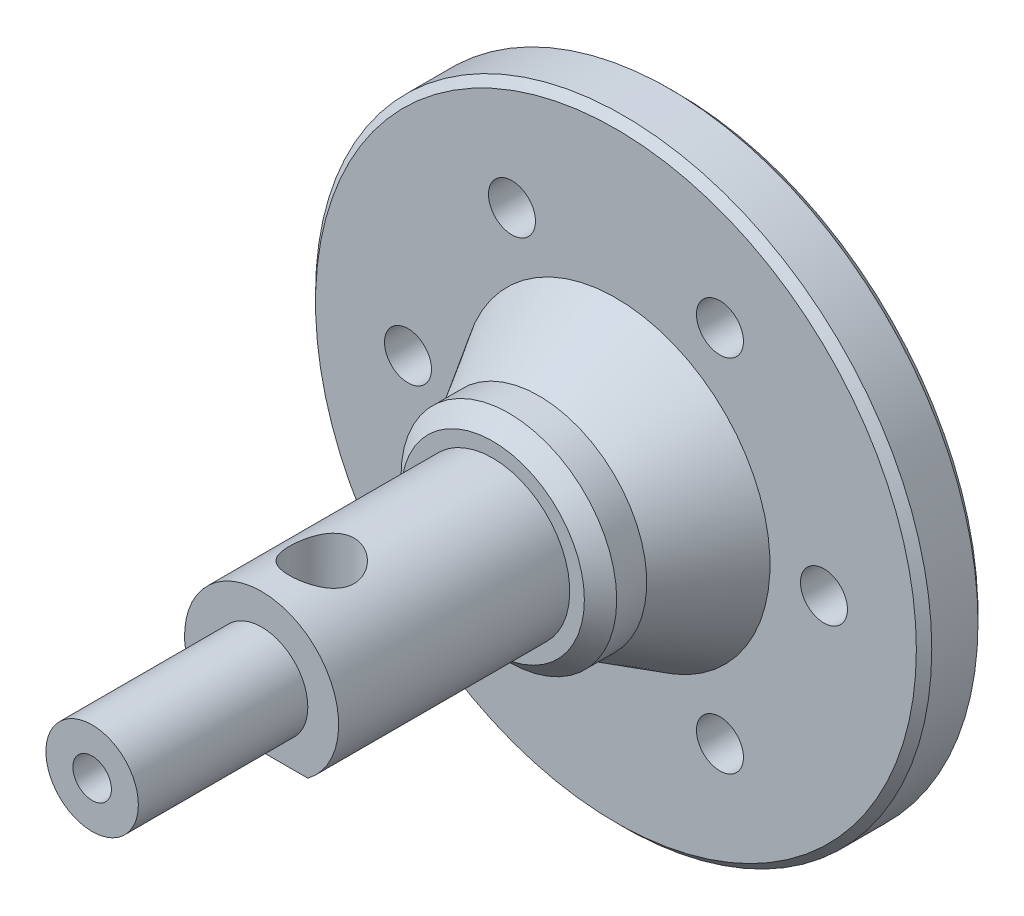
ISO-10303-21;
HEADER;
FILE_DESCRIPTION(('STEP AP214'),'2;1');
FILE_NAME('part.step','',(''),(''),'','','');
FILE_SCHEMA(('AUTOMOTIVE_DESIGN { 1 0 10303 214 1 1 1 1 }'));
ENDSEC;
DATA;
#1=APPLICATION_CONTEXT('core data for automotive mechanical design processes');
#2=APPLICATION_PROTOCOL_DEFINITION('international standard','automotive_design',2000,#1);
#3=PRODUCT_CONTEXT('',#1,'mechanical');
#4=PRODUCT('Part','Part','',(#3));
#5=PRODUCT_RELATED_PRODUCT_CATEGORY('part','',(#4));
#6=PRODUCT_DEFINITION_FORMATION('','',#4);
#7=PRODUCT_DEFINITION_CONTEXT('part definition',#1,'design');
#8=PRODUCT_DEFINITION('design','',#6,#7);
#9=PRODUCT_DEFINITION_SHAPE('','',#8);
#10=(LENGTH_UNIT() NAMED_UNIT(*) SI_UNIT(.MILLI.,.METRE.));
#11=(NAMED_UNIT(*) PLANE_ANGLE_UNIT() SI_UNIT($,.RADIAN.));
#12=(NAMED_UNIT(*) SI_UNIT($,.STERADIAN.) SOLID_ANGLE_UNIT());
#13=UNCERTAINTY_MEASURE_WITH_UNIT(LENGTH_MEASURE(1.E-05),#10,'distance_accuracy_value','');
#14=(GEOMETRIC_REPRESENTATION_CONTEXT(3) GLOBAL_UNCERTAINTY_ASSIGNED_CONTEXT((#13)) GLOBAL_UNIT_ASSIGNED_CONTEXT((#10,
#11,#12)) REPRESENTATION_CONTEXT('',''));
#15=CARTESIAN_POINT('',(0.,0.,0.));
#16=DIRECTION('',(0.,0.,1.));
#17=DIRECTION('',(1.,0.,0.));
#18=AXIS2_PLACEMENT_3D('',#15,#16,#17);
#19=CARTESIAN_POINT('',(0.,0.,9.));
#20=DIRECTION('',(0.,0.,-1.));
#21=DIRECTION('',(-1.,0.,0.));
#22=AXIS2_PLACEMENT_3D('',#19,#20,#21);
#23=CYLINDRICAL_SURFACE('',#22,7.);
#24=CARTESIAN_POINT('',(0.,0.,7.95));
#25=DIRECTION('',(0.,0.,1.));
#26=DIRECTION('',(1.,0.,0.));
#27=AXIS2_PLACEMENT_3D('',#24,#25,#26);
#28=CIRCLE('',#27,7.);
#29=CARTESIAN_POINT('',(7.,0.,7.95));
#30=VERTEX_POINT('',#29);
#31=EDGE_CURVE('E161',#30,#30,#28,.F.);
#32=ORIENTED_EDGE('',*,*,#31,.T.);
#33=EDGE_LOOP('',(#32));
#34=FACE_BOUND('',#33,.T.);
#35=CARTESIAN_POINT('',(0.,0.,6.00000000000002));
#36=DIRECTION('',(0.,0.,-1.));
#37=DIRECTION('',(-1.,0.,0.));
#38=AXIS2_PLACEMENT_3D('',#35,#36,#37);
#39=CIRCLE('',#38,7.);
#40=CARTESIAN_POINT('',(-7.,0.,6.00000000000002));
#41=VERTEX_POINT('',#40);
#42=EDGE_CURVE('E12',#41,#41,#39,.T.);
#43=ORIENTED_EDGE('',*,*,#42,.F.);
#44=EDGE_LOOP('',(#43));
#45=FACE_BOUND('',#44,.T.);
#46=ADVANCED_FACE('F49',(#34,#45),#23,.T.);
#47=CARTESIAN_POINT('',(0.,0.,9.));
#48=DIRECTION('',(0.,0.,1.));
#49=DIRECTION('',(1.,0.,0.));
#50=AXIS2_PLACEMENT_3D('',#47,#48,#49);
#51=PLANE('',#50);
#52=CARTESIAN_POINT('',(0.,0.,9.));
#53=DIRECTION('',(0.,0.,1.));
#54=DIRECTION('',(1.,0.,0.));
#55=AXIS2_PLACEMENT_3D('',#52,#53,#54);
#56=CIRCLE('',#55,5.95);
#57=CARTESIAN_POINT('',(5.95,0.,9.));
#58=VERTEX_POINT('',#57);
#59=EDGE_CURVE('E178',#58,#58,#56,.T.);
#60=ORIENTED_EDGE('',*,*,#59,.T.);
#61=EDGE_LOOP('',(#60));
#62=FACE_BOUND('',#61,.T.);
#63=CARTESIAN_POINT('',(0.,0.,9.));
#64=DIRECTION('',(0.,0.,1.));
#65=DIRECTION('',(1.,0.,0.));
#66=AXIS2_PLACEMENT_3D('',#63,#64,#65);
#67=CIRCLE('',#66,5.);
#68=CARTESIAN_POINT('',(3.,-4.,9.));
#69=VERTEX_POINT('',#68);
#70=CARTESIAN_POINT('',(-3.,-4.,9.));
#71=VERTEX_POINT('',#70);
#72=EDGE_CURVE('E174',#69,#71,#67,.T.);
#73=ORIENTED_EDGE('',*,*,#72,.F.);
#74=DIRECTION('',(-1.,0.,0.));
#75=VECTOR('',#74,1.);
#76=CARTESIAN_POINT('',(-3.,-4.,9.));
#77=LINE('',#76,#75);
#78=EDGE_CURVE('E162',#69,#71,#77,.T.);
#79=ORIENTED_EDGE('',*,*,#78,.T.);
#80=EDGE_LOOP('',(#73,#79));
#81=FACE_BOUND('',#80,.T.);
#82=ADVANCED_FACE('F220',(#62,#81),#51,.T.);
#83=CARTESIAN_POINT('',(0.,0.,24.));
#84=DIRECTION('',(0.,0.,-1.));
#85=DIRECTION('',(-1.,0.,0.));
#86=AXIS2_PLACEMENT_3D('',#83,#84,#85);
#87=CYLINDRICAL_SURFACE('',#86,5.);
#88=CARTESIAN_POINT('',(0.,5.,18.));
#89=CARTESIAN_POINT('',(0.112421260581153,4.99999333081063,18.0000087486642));
#90=CARTESIAN_POINT('',(0.22500040718686,4.99616592841195,18.0090785835812));
#91=CARTESIAN_POINT('',(0.446972248377442,4.98123118003201,18.0450254946232));
#92=CARTESIAN_POINT('',(0.556355935732328,4.97010500635269,18.0719486265488));
#93=CARTESIAN_POINT('',(0.768350398152637,4.94176430599483,18.1424330646887));
#94=CARTESIAN_POINT('',(0.870982883258437,4.92457055376415,18.1859376388004));
#95=CARTESIAN_POINT('',(1.06739278830025,4.8857658190477,18.2881128513417));
#96=CARTESIAN_POINT('',(1.16117280038008,4.8641561355186,18.3467790312891));
#97=CARTESIAN_POINT('',(1.34213382613879,4.81744880427699,18.4807616252732));
#98=CARTESIAN_POINT('',(1.42880573971968,4.79223574286274,18.5567250374545));
#99=CARTESIAN_POINT('',(1.58861874618106,4.74165902719199,18.7217771478338));
#100=CARTESIAN_POINT('',(1.66175260846298,4.71629529988631,18.8108728145304));
#101=CARTESIAN_POINT('',(1.79604183081053,4.66686358992508,19.0050780482677));
#102=CARTESIAN_POINT('',(1.8564119623006,4.64292449321022,19.110766844819));
#103=CARTESIAN_POINT('',(1.9582903452905,4.60088674913594,19.3319493636433));
#104=CARTESIAN_POINT('',(1.99980846754017,4.58278504680929,19.4474379171635));
#105=CARTESIAN_POINT('',(2.06069339629842,4.55572282316872,19.6790813748024));
#106=CARTESIAN_POINT('',(2.08104088310874,4.54635990340002,19.7949296749258));
#107=CARTESIAN_POINT('',(2.1020655645863,4.53668036024209,20.0287453768029));
#108=CARTESIAN_POINT('',(2.10275385885088,4.53635863218973,20.1467115451554));
#109=CARTESIAN_POINT('',(2.08517838863868,4.54445782632958,20.3715727342699));
#110=CARTESIAN_POINT('',(2.0683911211407,4.55219766109082,20.4786126533639));
#111=CARTESIAN_POINT('',(2.01882069425823,4.57439532890143,20.6881859698907));
#112=CARTESIAN_POINT('',(1.98603441325926,4.58885447294869,20.7907184836127));
#113=CARTESIAN_POINT('',(1.9047552653891,4.62318960000861,20.9909771898547));
#114=CARTESIAN_POINT('',(1.85594072765769,4.64317507109548,21.0885532080903));
#115=CARTESIAN_POINT('',(1.74421855126708,4.6862864975772,21.2745124807557));
#116=CARTESIAN_POINT('',(1.68130530506478,4.70941370110216,21.3628920569053));
#117=CARTESIAN_POINT('',(1.53682141436928,4.75862189879711,21.5359495731647));
#118=CARTESIAN_POINT('',(1.4541115363858,4.78478586969401,21.619655508531));
#119=CARTESIAN_POINT('',(1.27557303481868,4.83544396849842,21.7723379348816));
#120=CARTESIAN_POINT('',(1.17974124865652,4.85993769171256,21.8413108646979));
#121=CARTESIAN_POINT('',(0.974684985251579,4.90522758617355,21.9640261549959));
#122=CARTESIAN_POINT('',(0.865196096354339,4.92592190978332,22.0173670667239));
#123=CARTESIAN_POINT('',(0.637707645332215,4.96049707707325,22.1045304798802));
#124=CARTESIAN_POINT('',(0.519712906376766,4.97438174778904,22.1383639464055));
#125=CARTESIAN_POINT('',(0.286679920590251,4.99305470954801,22.1835035656391));
#126=CARTESIAN_POINT('',(0.171936368129354,4.9983686606607,22.1961137879832));
#127=CARTESIAN_POINT('',(-0.0581412446748196,5.00098385227943,22.2023443427462));
#128=CARTESIAN_POINT('',(-0.173475122118157,4.99828744042502,22.1959702390007));
#129=CARTESIAN_POINT('',(-0.395312373831661,4.98552504990215,22.1653412569326));
#130=CARTESIAN_POINT('',(-0.501967273863913,4.9758388790051,22.1420074752713));
#131=CARTESIAN_POINT('',(-0.709728637835148,4.95047932164883,22.0794093172166));
#132=CARTESIAN_POINT('',(-0.810834401783569,4.93480518181903,22.0401429362399));
#133=CARTESIAN_POINT('',(-1.00818189714743,4.8983626516293,21.9455130438461));
#134=CARTESIAN_POINT('',(-1.10417428723488,4.87745088709505,21.8896865485196));
#135=CARTESIAN_POINT('',(-1.28577300174089,4.83275775989048,21.7640291266551));
#136=CARTESIAN_POINT('',(-1.37137493586436,4.80897519262205,21.6941923131493));
#137=CARTESIAN_POINT('',(-1.53629380491231,4.75896603015302,21.5365709384711));
#138=CARTESIAN_POINT('',(-1.61470399849414,4.73268731102285,21.4478517714703));
#139=CARTESIAN_POINT('',(-1.75578239792247,4.68218504424203,21.2581054214289));
#140=CARTESIAN_POINT('',(-1.81844681280031,4.65796199244367,21.1570752830647));
#141=CARTESIAN_POINT('',(-1.92699302654218,4.61412955516253,20.9433676622428));
#142=CARTESIAN_POINT('',(-1.97260446871616,4.59459611805935,20.8305361230827));
#143=CARTESIAN_POINT('',(-2.04378702108545,4.56338397318404,20.5977144401677));
#144=CARTESIAN_POINT('',(-2.06937501482837,4.55169864915186,20.4777304193847));
#145=CARTESIAN_POINT('',(-2.09809375316399,4.53852721320538,20.2440877222975));
#146=CARTESIAN_POINT('',(-2.10281966121277,4.53631703032197,20.1306650987772));
#147=CARTESIAN_POINT('',(-2.09395263112574,4.54041709192146,19.9047070537751));
#148=CARTESIAN_POINT('',(-2.08036261579429,4.54672597695538,19.7921714936204));
#149=CARTESIAN_POINT('',(-2.03659654382613,4.56648699353874,19.5767598151772));
#150=CARTESIAN_POINT('',(-2.00724892567787,4.57958128170967,19.473679389714));
#151=CARTESIAN_POINT('',(-1.93361811208318,4.61115138706684,19.273885759783));
#152=CARTESIAN_POINT('',(-1.8893307059875,4.62962872121731,19.1771743595644));
#153=CARTESIAN_POINT('',(-1.78398506506627,4.67127236761429,18.9864581481377));
#154=CARTESIAN_POINT('',(-1.72207244546471,4.69465512938922,18.8929734165771));
#155=CARTESIAN_POINT('',(-1.58442236783439,4.74288120419634,18.7172211743398));
#156=CARTESIAN_POINT('',(-1.50867999331673,4.76772503450352,18.6349576710467));
#157=CARTESIAN_POINT('',(-1.33881414331682,4.81829681676583,18.4776737751763));
#158=CARTESIAN_POINT('',(-1.24374163979691,4.84395273633481,18.4036496464243));
#159=CARTESIAN_POINT('',(-1.04160910493705,4.89140406157461,18.2725495671045));
#160=CARTESIAN_POINT('',(-0.934543653723432,4.91319771021995,18.2154813221667));
#161=CARTESIAN_POINT('',(-0.712909694659769,4.95016391652071,18.1211131144848));
#162=CARTESIAN_POINT('',(-0.598488891919434,4.96543696653597,18.0835110625867));
#163=CARTESIAN_POINT('',(-0.423046442527793,4.98242021609108,18.0421727421728));
#164=CARTESIAN_POINT('',(-0.363983932156318,4.98709206933622,18.0309073949576));
#165=CARTESIAN_POINT('',(-0.244993842675941,4.99434801176813,18.013476395024));
#166=CARTESIAN_POINT('',(-0.185066849625885,4.99693345339788,18.0073074386877));
#167=CARTESIAN_POINT('',(-0.083378891468915,4.99947925927613,18.0012402094917));
#168=CARTESIAN_POINT('',(-0.0417003073719691,5.00000247379584,17.9999967548666));
#169=CARTESIAN_POINT('',(0.,5.,18.));
#170=B_SPLINE_CURVE_WITH_KNOTS('',3,(#88,#89,#90,#91,#92,#93,#94,#95,#96,#97,#98,#99,#100,#101,
#102,#103,#104,#105,#106,#107,#108,#109,#110,#111,#112,#113,#114,#115,#116,#117,#118,#119,#120,
#121,#122,#123,#124,#125,#126,#127,#128,#129,#130,#131,#132,#133,#134,#135,#136,#137,#138,#139,
#140,#141,#142,#143,#144,#145,#146,#147,#148,#149,#150,#151,#152,#153,#154,#155,#156,#157,#158,
#159,#160,#161,#162,#163,#164,#165,#166,#167,#168,#169),.UNSPECIFIED.,.T.,.F.,(4,2,2,2,2,2,2,2,
2,2,2,2,2,2,2,2,2,2,2,2,2,2,2,2,2,2,2,2,2,2,2,2,2,2,2,2,2,2,2,2,4),(0.,0.337117852409665,
0.675108761991061,1.01195349481189,1.34869928621511,1.70109212353727,2.05367263229608,
2.42394551964457,2.79402431110357,3.14607251211165,3.4979219424653,3.82228185888043,
4.14670508743035,4.47808378319004,4.80959451436098,5.16961532097,5.52972305127827,
5.89839924827029,6.26686801055249,6.61173647653919,6.95650388006769,7.28382587678933,
7.61118906878407,7.94874145558539,8.28643597605329,8.64863382013127,9.01091878393071,
9.37872565541541,9.74622206108762,10.0850701575655,10.4238641880037,10.7463772236012,
11.0689812327412,11.4111551885347,11.7534510251224,12.121249113885,12.4892140943469,
12.851283305836,13.0320009112092,13.2126012784391,13.337648071131),.UNSPECIFIED.);
#171=CARTESIAN_POINT('',(0.,5.,18.));
#172=VERTEX_POINT('',#171);
#173=EDGE_CURVE('E54',#172,#172,#170,.T.);
#174=ORIENTED_EDGE('',*,*,#173,.T.);
#175=EDGE_LOOP('',(#174));
#176=FACE_BOUND('',#175,.T.);
#177=CARTESIAN_POINT('',(0.,0.,24.));
#178=DIRECTION('',(0.,0.,1.));
#179=DIRECTION('',(1.,0.,0.));
#180=AXIS2_PLACEMENT_3D('',#177,#178,#179);
#181=CIRCLE('',#180,5.);
#182=CARTESIAN_POINT('',(3.,-4.,24.));
#183=VERTEX_POINT('',#182);
#184=CARTESIAN_POINT('',(-3.,-4.,24.));
#185=VERTEX_POINT('',#184);
#186=EDGE_CURVE('E169',#183,#185,#181,.T.);
#187=ORIENTED_EDGE('',*,*,#186,.F.);
#188=DIRECTION('',(0.,0.,1.));
#189=VECTOR('',#188,1.);
#190=CARTESIAN_POINT('',(3.,-4.,9.));
#191=LINE('',#190,#189);
#192=EDGE_CURVE('E73',#69,#183,#191,.T.);
#193=ORIENTED_EDGE('',*,*,#192,.F.);
#194=ORIENTED_EDGE('',*,*,#72,.T.);
#195=DIRECTION('',(0.,0.,1.));
#196=VECTOR('',#195,1.);
#197=CARTESIAN_POINT('',(-3.,-4.,9.));
#198=LINE('',#197,#196);
#199=EDGE_CURVE('E79',#71,#185,#198,.T.);
#200=ORIENTED_EDGE('',*,*,#199,.T.);
#201=EDGE_LOOP('',(#187,#193,#194,#200));
#202=FACE_BOUND('',#201,.T.);
#203=ADVANCED_FACE('F226',(#176,#202),#87,.T.);
#204=CARTESIAN_POINT('',(0.,0.,24.));
#205=DIRECTION('',(0.,0.,1.));
#206=DIRECTION('',(1.,0.,0.));
#207=AXIS2_PLACEMENT_3D('',#204,#205,#206);
#208=PLANE('',#207);
#209=CARTESIAN_POINT('',(0.,0.,24.));
#210=DIRECTION('',(0.,0.,1.));
#211=DIRECTION('',(1.,0.,0.));
#212=AXIS2_PLACEMENT_3D('',#209,#210,#211);
#213=CIRCLE('',#212,3.);
#214=CARTESIAN_POINT('',(3.,0.,24.));
#215=VERTEX_POINT('',#214);
#216=EDGE_CURVE('E156',#215,#215,#213,.T.);
#217=ORIENTED_EDGE('',*,*,#216,.F.);
#218=EDGE_LOOP('',(#217));
#219=FACE_BOUND('',#218,.T.);
#220=DIRECTION('',(-1.,0.,0.));
#221=VECTOR('',#220,1.);
#222=CARTESIAN_POINT('',(-3.,-4.,24.));
#223=LINE('',#222,#221);
#224=EDGE_CURVE('E85',#183,#185,#223,.T.);
#225=ORIENTED_EDGE('',*,*,#224,.F.);
#226=ORIENTED_EDGE('',*,*,#186,.T.);
#227=EDGE_LOOP('',(#225,#226));
#228=FACE_BOUND('',#227,.T.);
#229=ADVANCED_FACE('F262',(#219,#228),#208,.T.);
#230=CARTESIAN_POINT('',(0.,0.,9.));
#231=DIRECTION('',(0.,0.,-1.));
#232=DIRECTION('',(-1.,0.,0.));
#233=AXIS2_PLACEMENT_3D('',#230,#231,#232);
#234=CONICAL_SURFACE('',#233,5.95,0.785398163397448);
#235=ORIENTED_EDGE('',*,*,#31,.F.);
#236=EDGE_LOOP('',(#235));
#237=FACE_BOUND('',#236,.T.);
#238=ORIENTED_EDGE('',*,*,#59,.F.);
#239=EDGE_LOOP('',(#238));
#240=FACE_BOUND('',#239,.T.);
#241=ADVANCED_FACE('F256',(#237,#240),#234,.T.);
#242=CARTESIAN_POINT('',(-3.,-4.,9.));
#243=DIRECTION('',(0.,1.,0.));
#244=DIRECTION('',(0.,0.,1.));
#245=AXIS2_PLACEMENT_3D('',#242,#243,#244);
#246=PLANE('',#245);
#247=CARTESIAN_POINT('',(0.,-4.,20.1));
#248=DIRECTION('',(0.,-1.,0.));
#249=DIRECTION('',(0.,0.,-1.));
#250=AXIS2_PLACEMENT_3D('',#247,#248,#249);
#251=CIRCLE('',#250,2.09999999999999);
#252=CARTESIAN_POINT('',(0.,-4.,18.));
#253=VERTEX_POINT('',#252);
#254=EDGE_CURVE('E348',#253,#253,#251,.T.);
#255=ORIENTED_EDGE('',*,*,#254,.F.);
#256=EDGE_LOOP('',(#255));
#257=FACE_BOUND('',#256,.T.);
#258=ORIENTED_EDGE('',*,*,#224,.T.);
#259=ORIENTED_EDGE('',*,*,#199,.F.);
#260=ORIENTED_EDGE('',*,*,#78,.F.);
#261=ORIENTED_EDGE('',*,*,#192,.T.);
#262=EDGE_LOOP('',(#258,#259,#260,#261));
#263=FACE_BOUND('',#262,.T.);
#264=ADVANCED_FACE('F261',(#257,#263),#246,.F.);
#265=CARTESIAN_POINT('',(0.,0.,34.));
#266=DIRECTION('',(0.,0.,-1.));
#267=DIRECTION('',(-1.,0.,0.));
#268=AXIS2_PLACEMENT_3D('',#265,#266,#267);
#269=CYLINDRICAL_SURFACE('',#268,3.);
#270=ORIENTED_EDGE('',*,*,#216,.T.);
#271=EDGE_LOOP('',(#270));
#272=FACE_BOUND('',#271,.T.);
#273=CARTESIAN_POINT('',(0.,0.,35.));
#274=DIRECTION('',(0.,0.,1.));
#275=DIRECTION('',(1.,0.,0.));
#276=AXIS2_PLACEMENT_3D('',#273,#274,#275);
#277=CIRCLE('',#276,3.);
#278=CARTESIAN_POINT('',(3.,0.,35.));
#279=VERTEX_POINT('',#278);
#280=EDGE_CURVE('E99',#279,#279,#277,.T.);
#281=ORIENTED_EDGE('',*,*,#280,.F.);
#282=EDGE_LOOP('',(#281));
#283=FACE_BOUND('',#282,.T.);
#284=ADVANCED_FACE('F323',(#272,#283),#269,.T.);
#285=CARTESIAN_POINT('',(0.,0.,35.));
#286=DIRECTION('',(0.,0.,1.));
#287=DIRECTION('',(1.,0.,0.));
#288=AXIS2_PLACEMENT_3D('',#285,#286,#287);
#289=PLANE('',#288);
#290=CARTESIAN_POINT('',(0.,0.,35.));
#291=DIRECTION('',(0.,0.,1.));
#292=DIRECTION('',(1.,0.,0.));
#293=AXIS2_PLACEMENT_3D('',#290,#291,#292);
#294=CIRCLE('',#293,1.24999999999999);
#295=CARTESIAN_POINT('',(1.24999999999999,0.,35.));
#296=VERTEX_POINT('',#295);
#297=EDGE_CURVE('E100',#296,#296,#294,.T.);
#298=ORIENTED_EDGE('',*,*,#297,.F.);
#299=EDGE_LOOP('',(#298));
#300=FACE_BOUND('',#299,.T.);
#301=ORIENTED_EDGE('',*,*,#280,.T.);
#302=EDGE_LOOP('',(#301));
#303=FACE_BOUND('',#302,.T.);
#304=ADVANCED_FACE('F92',(#300,#303),#289,.T.);
#305=CARTESIAN_POINT('',(0.,0.,30.));
#306=DIRECTION('',(0.,0.,1.));
#307=DIRECTION('',(1.,0.,0.));
#308=AXIS2_PLACEMENT_3D('',#305,#306,#307);
#309=CONICAL_SURFACE('',#308,1.24999999999999,1.02974425867665);
#310=CARTESIAN_POINT('',(0.,0.,29.2489242262156));
#311=VERTEX_POINT('',#310);
#312=VERTEX_LOOP('',#311);
#313=FACE_BOUND('',#312,.T.);
#314=CARTESIAN_POINT('',(0.,0.,30.));
#315=DIRECTION('',(0.,0.,1.));
#316=DIRECTION('',(1.,0.,0.));
#317=AXIS2_PLACEMENT_3D('',#314,#315,#316);
#318=CIRCLE('',#317,1.24999999999999);
#319=CARTESIAN_POINT('',(1.24999999999999,0.,30.));
#320=VERTEX_POINT('',#319);
#321=EDGE_CURVE('E96',#320,#320,#318,.T.);
#322=ORIENTED_EDGE('',*,*,#321,.T.);
#323=EDGE_LOOP('',(#322));
#324=FACE_BOUND('',#323,.T.);
#325=ADVANCED_FACE('F88',(#313,#324),#309,.F.);
#326=CARTESIAN_POINT('',(0.,0.,35.));
#327=DIRECTION('',(0.,0.,1.));
#328=DIRECTION('',(1.,0.,0.));
#329=AXIS2_PLACEMENT_3D('',#326,#327,#328);
#330=CYLINDRICAL_SURFACE('',#329,1.24999999999999);
#331=ORIENTED_EDGE('',*,*,#321,.F.);
#332=EDGE_LOOP('',(#331));
#333=FACE_BOUND('',#332,.T.);
#334=ORIENTED_EDGE('',*,*,#297,.T.);
#335=EDGE_LOOP('',(#334));
#336=FACE_BOUND('',#335,.T.);
#337=ADVANCED_FACE('F91',(#333,#336),#330,.F.);
#338=CARTESIAN_POINT('',(0.,-4.,20.1));
#339=DIRECTION('',(0.,-1.,0.));
#340=DIRECTION('',(0.,0.,-1.));
#341=AXIS2_PLACEMENT_3D('',#338,#339,#340);
#342=CYLINDRICAL_SURFACE('',#341,2.09999999999999);
#343=ORIENTED_EDGE('',*,*,#254,.T.);
#344=EDGE_LOOP('',(#343));
#345=FACE_BOUND('',#344,.T.);
#346=ORIENTED_EDGE('',*,*,#173,.F.);
#347=EDGE_LOOP('',(#346));
#348=FACE_BOUND('',#347,.T.);
#349=ADVANCED_FACE('F276',(#345,#348),#342,.F.);
#350=CARTESIAN_POINT('',(0.,0.,6.83333333333333));
#351=DIRECTION('',(0.,0.,-1.));
#352=DIRECTION('',(-1.,0.,0.));
#353=AXIS2_PLACEMENT_3D('',#350,#351,#352);
#354=CONICAL_SURFACE('',#353,6.50000000000001,0.540419500270584);
#355=CARTESIAN_POINT('',(0.,0.,1.));
#356=DIRECTION('',(0.,0.,-1.));
#357=DIRECTION('',(-1.,0.,0.));
#358=AXIS2_PLACEMENT_3D('',#355,#356,#357);
#359=CIRCLE('',#358,10.);
#360=CARTESIAN_POINT('',(-10.,0.,1.));
#361=VERTEX_POINT('',#360);
#362=EDGE_CURVE('E350',#361,#361,#359,.T.);
#363=ORIENTED_EDGE('',*,*,#362,.F.);
#364=EDGE_LOOP('',(#363));
#365=FACE_BOUND('',#364,.T.);
#366=ORIENTED_EDGE('',*,*,#42,.T.);
#367=EDGE_LOOP('',(#366));
#368=FACE_BOUND('',#367,.T.);
#369=ADVANCED_FACE('F268',(#365,#368),#354,.T.);
#370=CARTESIAN_POINT('',(0.,0.,-3.));
#371=DIRECTION('',(0.,0.,1.));
#372=DIRECTION('',(1.,0.,0.));
#373=AXIS2_PLACEMENT_3D('',#370,#371,#372);
#374=CONICAL_SURFACE('',#373,19.5,0.785398163397441);
#375=CARTESIAN_POINT('',(0.,0.,-2.5));
#376=DIRECTION('',(0.,0.,-1.));
#377=DIRECTION('',(-1.,0.,0.));
#378=AXIS2_PLACEMENT_3D('',#375,#376,#377);
#379=CIRCLE('',#378,20.);
#380=CARTESIAN_POINT('',(-20.,0.,-2.5));
#381=VERTEX_POINT('',#380);
#382=EDGE_CURVE('E195',#381,#381,#379,.F.);
#383=ORIENTED_EDGE('',*,*,#382,.F.);
#384=EDGE_LOOP('',(#383));
#385=FACE_BOUND('',#384,.T.);
#386=CARTESIAN_POINT('',(0.,0.,-3.));
#387=DIRECTION('',(0.,0.,-1.));
#388=DIRECTION('',(-1.,0.,0.));
#389=AXIS2_PLACEMENT_3D('',#386,#387,#388);
#390=CIRCLE('',#389,19.5);
#391=CARTESIAN_POINT('',(-19.5,0.,-3.));
#392=VERTEX_POINT('',#391);
#393=EDGE_CURVE('E160',#392,#392,#390,.T.);
#394=ORIENTED_EDGE('',*,*,#393,.F.);
#395=EDGE_LOOP('',(#394));
#396=FACE_BOUND('',#395,.T.);
#397=ADVANCED_FACE('F264',(#385,#396),#374,.T.);
#398=CARTESIAN_POINT('',(0.,0.,-3.));
#399=DIRECTION('',(0.,0.,-1.));
#400=DIRECTION('',(-1.,0.,0.));
#401=AXIS2_PLACEMENT_3D('',#398,#399,#400);
#402=PLANE('',#401);
#403=ORIENTED_EDGE('',*,*,#393,.T.);
#404=EDGE_LOOP('',(#403));
#405=FACE_BOUND('',#404,.T.);
#406=CARTESIAN_POINT('',(13.5,0.,-3.));
#407=DIRECTION('',(0.,0.,-1.));
#408=DIRECTION('',(-1.,0.,0.));
#409=AXIS2_PLACEMENT_3D('',#406,#407,#408);
#410=CIRCLE('',#409,1.525);
#411=CARTESIAN_POINT('',(11.975,0.,-3.));
#412=VERTEX_POINT('',#411);
#413=EDGE_CURVE('E137',#412,#412,#410,.T.);
#414=ORIENTED_EDGE('',*,*,#413,.F.);
#415=EDGE_LOOP('',(#414));
#416=FACE_BOUND('',#415,.T.);
#417=CARTESIAN_POINT('',(-6.75000000000005,-11.6913429510899,-3.));
#418=DIRECTION('',(0.,0.,-1.));
#419=DIRECTION('',(-1.,0.,0.));
#420=AXIS2_PLACEMENT_3D('',#417,#418,#419);
#421=CIRCLE('',#420,1.525);
#422=CARTESIAN_POINT('',(-8.27500000000006,-11.6913429510899,-3.));
#423=VERTEX_POINT('',#422);
#424=EDGE_CURVE('E145',#423,#423,#421,.T.);
#425=ORIENTED_EDGE('',*,*,#424,.F.);
#426=EDGE_LOOP('',(#425));
#427=FACE_BOUND('',#426,.T.);
#428=CARTESIAN_POINT('',(-6.74999999999989,11.69134295109,-3.));
#429=DIRECTION('',(0.,0.,-1.));
#430=DIRECTION('',(-1.,0.,0.));
#431=AXIS2_PLACEMENT_3D('',#428,#429,#430);
#432=CIRCLE('',#431,1.525);
#433=CARTESIAN_POINT('',(-8.27499999999989,11.69134295109,-3.));
#434=VERTEX_POINT('',#433);
#435=EDGE_CURVE('E152',#434,#434,#432,.T.);
#436=ORIENTED_EDGE('',*,*,#435,.F.);
#437=EDGE_LOOP('',(#436));
#438=FACE_BOUND('',#437,.T.);
#439=CARTESIAN_POINT('',(-13.5,0.,-3.));
#440=DIRECTION('',(0.,0.,-1.));
#441=DIRECTION('',(-1.,0.,0.));
#442=AXIS2_PLACEMENT_3D('',#439,#440,#441);
#443=CIRCLE('',#442,1.525);
#444=CARTESIAN_POINT('',(-15.025,0.,-3.));
#445=VERTEX_POINT('',#444);
#446=EDGE_CURVE('E148',#445,#445,#443,.T.);
#447=ORIENTED_EDGE('',*,*,#446,.F.);
#448=EDGE_LOOP('',(#447));
#449=FACE_BOUND('',#448,.T.);
#450=CARTESIAN_POINT('',(6.74999999999997,-11.6913429510899,-3.));
#451=DIRECTION('',(0.,0.,-1.));
#452=DIRECTION('',(-1.,0.,0.));
#453=AXIS2_PLACEMENT_3D('',#450,#451,#452);
#454=CIRCLE('',#453,1.525);
#455=CARTESIAN_POINT('',(5.22499999999997,-11.6913429510899,-3.));
#456=VERTEX_POINT('',#455);
#457=EDGE_CURVE('E141',#456,#456,#454,.T.);
#458=ORIENTED_EDGE('',*,*,#457,.F.);
#459=EDGE_LOOP('',(#458));
#460=FACE_BOUND('',#459,.T.);
#461=CARTESIAN_POINT('',(6.75000000000014,11.6913429510898,-3.));
#462=DIRECTION('',(0.,0.,-1.));
#463=DIRECTION('',(-1.,0.,0.));
#464=AXIS2_PLACEMENT_3D('',#461,#462,#463);
#465=CIRCLE('',#464,1.525);
#466=CARTESIAN_POINT('',(5.22500000000014,11.6913429510898,-3.));
#467=VERTEX_POINT('',#466);
#468=EDGE_CURVE('E133',#467,#467,#465,.T.);
#469=ORIENTED_EDGE('',*,*,#468,.F.);
#470=EDGE_LOOP('',(#469));
#471=FACE_BOUND('',#470,.T.);
#472=ADVANCED_FACE('F253',(#405,#416,#427,#438,#449,#460,#471),#402,.T.);
#473=CARTESIAN_POINT('',(0.,0.,5.));
#474=DIRECTION('',(0.,0.,-1.));
#475=DIRECTION('',(-1.,0.,0.));
#476=AXIS2_PLACEMENT_3D('',#473,#474,#475);
#477=CYLINDRICAL_SURFACE('',#476,20.);
#478=ORIENTED_EDGE('',*,*,#382,.T.);
#479=EDGE_LOOP('',(#478));
#480=FACE_BOUND('',#479,.T.);
#481=CARTESIAN_POINT('',(0.,0.,0.499999999999986));
#482=DIRECTION('',(0.,0.,1.));
#483=DIRECTION('',(1.,0.,0.));
#484=AXIS2_PLACEMENT_3D('',#481,#482,#483);
#485=CIRCLE('',#484,20.);
#486=CARTESIAN_POINT('',(20.,0.,0.499999999999986));
#487=VERTEX_POINT('',#486);
#488=EDGE_CURVE('E191',#487,#487,#485,.F.);
#489=ORIENTED_EDGE('',*,*,#488,.T.);
#490=EDGE_LOOP('',(#489));
#491=FACE_BOUND('',#490,.T.);
#492=ADVANCED_FACE('F239',(#480,#491),#477,.T.);
#493=CARTESIAN_POINT('',(6.74999999999997,-11.6913429510899,0.));
#494=DIRECTION('',(0.,0.,1.));
#495=DIRECTION('',(1.,0.,0.));
#496=AXIS2_PLACEMENT_3D('',#493,#494,#495);
#497=CYLINDRICAL_SURFACE('',#496,1.525);
#498=ORIENTED_EDGE('',*,*,#457,.T.);
#499=EDGE_LOOP('',(#498));
#500=FACE_BOUND('',#499,.T.);
#501=CARTESIAN_POINT('',(6.74999999999997,-11.6913429510899,1.));
#502=DIRECTION('',(0.,0.,1.));
#503=DIRECTION('',(1.,0.,0.));
#504=AXIS2_PLACEMENT_3D('',#501,#502,#503);
#505=CIRCLE('',#504,1.525);
#506=CARTESIAN_POINT('',(8.27499999999997,-11.6913429510899,1.));
#507=VERTEX_POINT('',#506);
#508=EDGE_CURVE('E129',#507,#507,#505,.F.);
#509=ORIENTED_EDGE('',*,*,#508,.F.);
#510=EDGE_LOOP('',(#509));
#511=FACE_BOUND('',#510,.T.);
#512=ADVANCED_FACE('F235',(#500,#511),#497,.F.);
#513=CARTESIAN_POINT('',(-6.75000000000005,-11.6913429510899,0.));
#514=DIRECTION('',(0.,0.,1.));
#515=DIRECTION('',(1.,0.,0.));
#516=AXIS2_PLACEMENT_3D('',#513,#514,#515);
#517=CYLINDRICAL_SURFACE('',#516,1.525);
#518=ORIENTED_EDGE('',*,*,#424,.T.);
#519=EDGE_LOOP('',(#518));
#520=FACE_BOUND('',#519,.T.);
#521=CARTESIAN_POINT('',(-6.75000000000005,-11.6913429510899,1.));
#522=DIRECTION('',(0.,0.,1.));
#523=DIRECTION('',(1.,0.,0.));
#524=AXIS2_PLACEMENT_3D('',#521,#522,#523);
#525=CIRCLE('',#524,1.525);
#526=CARTESIAN_POINT('',(-5.22500000000005,-11.6913429510899,1.));
#527=VERTEX_POINT('',#526);
#528=EDGE_CURVE('E125',#527,#527,#525,.F.);
#529=ORIENTED_EDGE('',*,*,#528,.F.);
#530=EDGE_LOOP('',(#529));
#531=FACE_BOUND('',#530,.T.);
#532=ADVANCED_FACE('F238',(#520,#531),#517,.F.);
#533=CARTESIAN_POINT('',(-13.5,0.,0.));
#534=DIRECTION('',(0.,0.,1.));
#535=DIRECTION('',(1.,0.,0.));
#536=AXIS2_PLACEMENT_3D('',#533,#534,#535);
#537=CYLINDRICAL_SURFACE('',#536,1.525);
#538=ORIENTED_EDGE('',*,*,#446,.T.);
#539=EDGE_LOOP('',(#538));
#540=FACE_BOUND('',#539,.T.);
#541=CARTESIAN_POINT('',(-13.5,0.,1.));
#542=DIRECTION('',(0.,0.,1.));
#543=DIRECTION('',(1.,0.,0.));
#544=AXIS2_PLACEMENT_3D('',#541,#542,#543);
#545=CIRCLE('',#544,1.525);
#546=CARTESIAN_POINT('',(-11.975,0.,1.));
#547=VERTEX_POINT('',#546);
#548=EDGE_CURVE('E121',#547,#547,#545,.F.);
#549=ORIENTED_EDGE('',*,*,#548,.F.);
#550=EDGE_LOOP('',(#549));
#551=FACE_BOUND('',#550,.T.);
#552=ADVANCED_FACE('F243',(#540,#551),#537,.F.);
#553=CARTESIAN_POINT('',(-6.74999999999989,11.69134295109,0.));
#554=DIRECTION('',(0.,0.,1.));
#555=DIRECTION('',(1.,0.,0.));
#556=AXIS2_PLACEMENT_3D('',#553,#554,#555);
#557=CYLINDRICAL_SURFACE('',#556,1.525);
#558=ORIENTED_EDGE('',*,*,#435,.T.);
#559=EDGE_LOOP('',(#558));
#560=FACE_BOUND('',#559,.T.);
#561=CARTESIAN_POINT('',(-6.74999999999989,11.69134295109,1.));
#562=DIRECTION('',(0.,0.,1.));
#563=DIRECTION('',(1.,0.,0.));
#564=AXIS2_PLACEMENT_3D('',#561,#562,#563);
#565=CIRCLE('',#564,1.525);
#566=CARTESIAN_POINT('',(-5.22499999999989,11.69134295109,1.));
#567=VERTEX_POINT('',#566);
#568=EDGE_CURVE('E117',#567,#567,#565,.F.);
#569=ORIENTED_EDGE('',*,*,#568,.F.);
#570=EDGE_LOOP('',(#569));
#571=FACE_BOUND('',#570,.T.);
#572=ADVANCED_FACE('F233',(#560,#571),#557,.F.);
#573=CARTESIAN_POINT('',(6.75000000000014,11.6913429510898,0.));
#574=DIRECTION('',(0.,0.,1.));
#575=DIRECTION('',(1.,0.,0.));
#576=AXIS2_PLACEMENT_3D('',#573,#574,#575);
#577=CYLINDRICAL_SURFACE('',#576,1.525);
#578=ORIENTED_EDGE('',*,*,#468,.T.);
#579=EDGE_LOOP('',(#578));
#580=FACE_BOUND('',#579,.T.);
#581=CARTESIAN_POINT('',(6.75000000000014,11.6913429510898,1.));
#582=DIRECTION('',(0.,0.,1.));
#583=DIRECTION('',(1.,0.,0.));
#584=AXIS2_PLACEMENT_3D('',#581,#582,#583);
#585=CIRCLE('',#584,1.525);
#586=CARTESIAN_POINT('',(8.27500000000014,11.6913429510898,1.));
#587=VERTEX_POINT('',#586);
#588=EDGE_CURVE('E113',#587,#587,#585,.F.);
#589=ORIENTED_EDGE('',*,*,#588,.F.);
#590=EDGE_LOOP('',(#589));
#591=FACE_BOUND('',#590,.T.);
#592=ADVANCED_FACE('F215',(#580,#591),#577,.F.);
#593=CARTESIAN_POINT('',(13.5,0.,0.));
#594=DIRECTION('',(0.,0.,1.));
#595=DIRECTION('',(1.,0.,0.));
#596=AXIS2_PLACEMENT_3D('',#593,#594,#595);
#597=CYLINDRICAL_SURFACE('',#596,1.525);
#598=ORIENTED_EDGE('',*,*,#413,.T.);
#599=EDGE_LOOP('',(#598));
#600=FACE_BOUND('',#599,.T.);
#601=CARTESIAN_POINT('',(13.5,0.,1.));
#602=DIRECTION('',(0.,0.,1.));
#603=DIRECTION('',(1.,0.,0.));
#604=AXIS2_PLACEMENT_3D('',#601,#602,#603);
#605=CIRCLE('',#604,1.525);
#606=CARTESIAN_POINT('',(15.025,0.,1.));
#607=VERTEX_POINT('',#606);
#608=EDGE_CURVE('E106',#607,#607,#605,.F.);
#609=ORIENTED_EDGE('',*,*,#608,.F.);
#610=EDGE_LOOP('',(#609));
#611=FACE_BOUND('',#610,.T.);
#612=ADVANCED_FACE('F207',(#600,#611),#597,.F.);
#613=CARTESIAN_POINT('',(0.,0.,1.));
#614=DIRECTION('',(0.,0.,-1.));
#615=DIRECTION('',(-1.,0.,0.));
#616=AXIS2_PLACEMENT_3D('',#613,#614,#615);
#617=CONICAL_SURFACE('',#616,19.5,0.785398163397441);
#618=ORIENTED_EDGE('',*,*,#488,.F.);
#619=EDGE_LOOP('',(#618));
#620=FACE_BOUND('',#619,.T.);
#621=CARTESIAN_POINT('',(0.,0.,1.));
#622=DIRECTION('',(0.,0.,1.));
#623=DIRECTION('',(1.,0.,0.));
#624=AXIS2_PLACEMENT_3D('',#621,#622,#623);
#625=CIRCLE('',#624,19.5);
#626=CARTESIAN_POINT('',(19.5,0.,1.));
#627=VERTEX_POINT('',#626);
#628=EDGE_CURVE('E65',#627,#627,#625,.T.);
#629=ORIENTED_EDGE('',*,*,#628,.F.);
#630=EDGE_LOOP('',(#629));
#631=FACE_BOUND('',#630,.T.);
#632=ADVANCED_FACE('F52',(#620,#631),#617,.T.);
#633=CARTESIAN_POINT('',(0.,0.,1.));
#634=DIRECTION('',(0.,0.,1.));
#635=DIRECTION('',(1.,0.,0.));
#636=AXIS2_PLACEMENT_3D('',#633,#634,#635);
#637=PLANE('',#636);
#638=ORIENTED_EDGE('',*,*,#362,.T.);
#639=EDGE_LOOP('',(#638));
#640=FACE_BOUND('',#639,.T.);
#641=ORIENTED_EDGE('',*,*,#628,.T.);
#642=EDGE_LOOP('',(#641));
#643=FACE_BOUND('',#642,.T.);
#644=ORIENTED_EDGE('',*,*,#608,.T.);
#645=EDGE_LOOP('',(#644));
#646=FACE_BOUND('',#645,.T.);
#647=ORIENTED_EDGE('',*,*,#588,.T.);
#648=EDGE_LOOP('',(#647));
#649=FACE_BOUND('',#648,.T.);
#650=ORIENTED_EDGE('',*,*,#568,.T.);
#651=EDGE_LOOP('',(#650));
#652=FACE_BOUND('',#651,.T.);
#653=ORIENTED_EDGE('',*,*,#548,.T.);
#654=EDGE_LOOP('',(#653));
#655=FACE_BOUND('',#654,.T.);
#656=ORIENTED_EDGE('',*,*,#528,.T.);
#657=EDGE_LOOP('',(#656));
#658=FACE_BOUND('',#657,.T.);
#659=ORIENTED_EDGE('',*,*,#508,.T.);
#660=EDGE_LOOP('',(#659));
#661=FACE_BOUND('',#660,.T.);
#662=ADVANCED_FACE('F203',(#640,#643,#646,#649,#652,#655,#658,#661),#637,.T.);
#663=CLOSED_SHELL('',(#46,#82,#203,#229,#241,#264,#284,#304,#325,#337,#349,#369,#397,#472,#492,
#512,#532,#552,#572,#592,#612,#632,#662));
#664=MANIFOLD_SOLID_BREP('B2',#663);
#665=ADVANCED_BREP_SHAPE_REPRESENTATION('',(#18,#664),#14);
#666=SHAPE_DEFINITION_REPRESENTATION(#9,#665);
ENDSEC;
END-ISO-10303-21;
